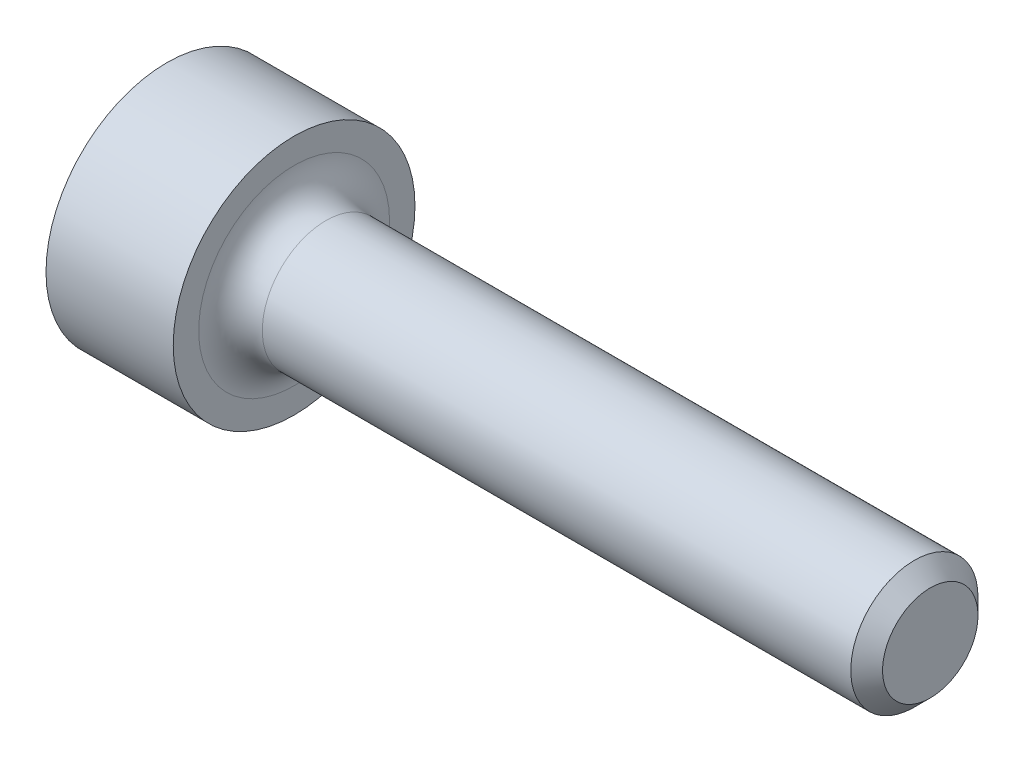
ISO-10303-21;
HEADER;
FILE_DESCRIPTION(('STEP AP214'),'2;1');
FILE_NAME('part.step','',(''),(''),'','','');
FILE_SCHEMA(('AUTOMOTIVE_DESIGN { 1 0 10303 214 1 1 1 1 }'));
ENDSEC;
DATA;
#1=APPLICATION_CONTEXT('core data for automotive mechanical design processes');
#2=APPLICATION_PROTOCOL_DEFINITION('international standard','automotive_design',2000,#1);
#3=PRODUCT_CONTEXT('',#1,'mechanical');
#4=PRODUCT('Part','Part','',(#3));
#5=PRODUCT_RELATED_PRODUCT_CATEGORY('part','',(#4));
#6=PRODUCT_DEFINITION_FORMATION('','',#4);
#7=PRODUCT_DEFINITION_CONTEXT('part definition',#1,'design');
#8=PRODUCT_DEFINITION('design','',#6,#7);
#9=PRODUCT_DEFINITION_SHAPE('','',#8);
#10=(LENGTH_UNIT() NAMED_UNIT(*) SI_UNIT(.MILLI.,.METRE.));
#11=(NAMED_UNIT(*) PLANE_ANGLE_UNIT() SI_UNIT($,.RADIAN.));
#12=(NAMED_UNIT(*) SI_UNIT($,.STERADIAN.) SOLID_ANGLE_UNIT());
#13=UNCERTAINTY_MEASURE_WITH_UNIT(LENGTH_MEASURE(1.E-05),#10,'distance_accuracy_value','');
#14=(GEOMETRIC_REPRESENTATION_CONTEXT(3) GLOBAL_UNCERTAINTY_ASSIGNED_CONTEXT((#13)) GLOBAL_UNIT_ASSIGNED_CONTEXT((#10,
#11,#12)) REPRESENTATION_CONTEXT('',''));
#15=CARTESIAN_POINT('',(0.,0.,0.));
#16=DIRECTION('',(0.,0.,1.));
#17=DIRECTION('',(1.,0.,0.));
#18=AXIS2_PLACEMENT_3D('',#15,#16,#17);
#19=CARTESIAN_POINT('',(12.,0.,0.));
#20=DIRECTION('',(1.,0.,0.));
#21=DIRECTION('',(0.,0.,-1.));
#22=AXIS2_PLACEMENT_3D('',#19,#20,#21);
#23=PLANE('',#22);
#24=CARTESIAN_POINT('',(12.,0.,0.));
#25=DIRECTION('',(1.,0.,0.));
#26=DIRECTION('',(0.,0.,-1.));
#27=AXIS2_PLACEMENT_3D('',#24,#25,#26);
#28=CIRCLE('',#27,0.750000000000001);
#29=CARTESIAN_POINT('',(12.,0.,-0.750000000000001));
#30=VERTEX_POINT('',#29);
#31=EDGE_CURVE('E11',#30,#30,#28,.T.);
#32=ORIENTED_EDGE('',*,*,#31,.T.);
#33=EDGE_LOOP('',(#32));
#34=FACE_BOUND('',#33,.T.);
#35=ADVANCED_FACE('F41',(#34),#23,.T.);
#36=CARTESIAN_POINT('',(0.,0.,0.));
#37=DIRECTION('',(-1.,0.,0.));
#38=DIRECTION('',(0.,0.,1.));
#39=AXIS2_PLACEMENT_3D('',#36,#37,#38);
#40=CYLINDRICAL_SURFACE('',#39,1.);
#41=CARTESIAN_POINT('',(11.75,0.,0.));
#42=DIRECTION('',(1.,0.,0.));
#43=DIRECTION('',(0.,0.,-1.));
#44=AXIS2_PLACEMENT_3D('',#41,#42,#43);
#45=CIRCLE('',#44,1.);
#46=CARTESIAN_POINT('',(11.75,0.,-1.));
#47=VERTEX_POINT('',#46);
#48=EDGE_CURVE('E49',#47,#47,#45,.F.);
#49=ORIENTED_EDGE('',*,*,#48,.T.);
#50=EDGE_LOOP('',(#49));
#51=FACE_BOUND('',#50,.T.);
#52=CARTESIAN_POINT('',(2.5,0.,0.));
#53=DIRECTION('',(1.,0.,0.));
#54=DIRECTION('',(0.,0.,-1.));
#55=AXIS2_PLACEMENT_3D('',#52,#53,#54);
#56=CIRCLE('',#55,1.);
#57=CARTESIAN_POINT('',(2.5,0.,-1.));
#58=VERTEX_POINT('',#57);
#59=EDGE_CURVE('E135',#58,#58,#56,.T.);
#60=ORIENTED_EDGE('',*,*,#59,.T.);
#61=EDGE_LOOP('',(#60));
#62=FACE_BOUND('',#61,.T.);
#63=ADVANCED_FACE('F140',(#51,#62),#40,.T.);
#64=CARTESIAN_POINT('',(2.,-1.9,0.));
#65=DIRECTION('',(1.,0.,0.));
#66=DIRECTION('',(0.,0.,-1.));
#67=AXIS2_PLACEMENT_3D('',#64,#65,#66);
#68=PLANE('',#67);
#69=CARTESIAN_POINT('',(2.,0.,0.));
#70=DIRECTION('',(1.,0.,0.));
#71=DIRECTION('',(0.,0.,-1.));
#72=AXIS2_PLACEMENT_3D('',#69,#70,#71);
#73=CIRCLE('',#72,1.5);
#74=CARTESIAN_POINT('',(2.,0.,-1.5));
#75=VERTEX_POINT('',#74);
#76=EDGE_CURVE('E132',#75,#75,#73,.F.);
#77=ORIENTED_EDGE('',*,*,#76,.T.);
#78=EDGE_LOOP('',(#77));
#79=FACE_BOUND('',#78,.T.);
#80=CARTESIAN_POINT('',(2.,0.,0.));
#81=DIRECTION('',(-1.,0.,0.));
#82=DIRECTION('',(0.,0.,1.));
#83=AXIS2_PLACEMENT_3D('',#80,#81,#82);
#84=CIRCLE('',#83,1.9);
#85=CARTESIAN_POINT('',(2.,0.,1.9));
#86=VERTEX_POINT('',#85);
#87=EDGE_CURVE('E129',#86,#86,#84,.T.);
#88=ORIENTED_EDGE('',*,*,#87,.F.);
#89=EDGE_LOOP('',(#88));
#90=FACE_BOUND('',#89,.T.);
#91=ADVANCED_FACE('F159',(#79,#90),#68,.T.);
#92=CARTESIAN_POINT('',(0.,0.,0.));
#93=DIRECTION('',(-1.,0.,0.));
#94=DIRECTION('',(0.,0.,1.));
#95=AXIS2_PLACEMENT_3D('',#92,#93,#94);
#96=CYLINDRICAL_SURFACE('',#95,1.9);
#97=ORIENTED_EDGE('',*,*,#87,.T.);
#98=EDGE_LOOP('',(#97));
#99=FACE_BOUND('',#98,.T.);
#100=CARTESIAN_POINT('',(0.,0.,0.));
#101=DIRECTION('',(-1.,0.,0.));
#102=DIRECTION('',(0.,0.,1.));
#103=AXIS2_PLACEMENT_3D('',#100,#101,#102);
#104=CIRCLE('',#103,1.9);
#105=CARTESIAN_POINT('',(0.,0.,1.9));
#106=VERTEX_POINT('',#105);
#107=EDGE_CURVE('E118',#106,#106,#104,.T.);
#108=ORIENTED_EDGE('',*,*,#107,.F.);
#109=EDGE_LOOP('',(#108));
#110=FACE_BOUND('',#109,.T.);
#111=ADVANCED_FACE('F171',(#99,#110),#96,.T.);
#112=CARTESIAN_POINT('',(0.,0.,0.));
#113=DIRECTION('',(-1.,0.,0.));
#114=DIRECTION('',(0.,0.,1.));
#115=AXIS2_PLACEMENT_3D('',#112,#113,#114);
#116=PLANE('',#115);
#117=DIRECTION('',(0.,0.5,-0.866025403784439));
#118=VECTOR('',#117,1.);
#119=CARTESIAN_POINT('',(0.,0.43301270189222,0.749999999999999));
#120=LINE('',#119,#118);
#121=CARTESIAN_POINT('',(0.,0.43301270189222,0.749999999999999));
#122=VERTEX_POINT('',#121);
#123=CARTESIAN_POINT('',(0.,0.866025403784439,0.));
#124=VERTEX_POINT('',#123);
#125=EDGE_CURVE('E56',#122,#124,#120,.T.);
#126=ORIENTED_EDGE('',*,*,#125,.F.);
#127=DIRECTION('',(0.,1.,0.));
#128=VECTOR('',#127,1.);
#129=CARTESIAN_POINT('',(0.,-0.433012701892219,0.75));
#130=LINE('',#129,#128);
#131=CARTESIAN_POINT('',(0.,-0.433012701892219,0.75));
#132=VERTEX_POINT('',#131);
#133=EDGE_CURVE('E91',#132,#122,#130,.T.);
#134=ORIENTED_EDGE('',*,*,#133,.F.);
#135=DIRECTION('',(0.,0.5,0.866025403784439));
#136=VECTOR('',#135,1.);
#137=CARTESIAN_POINT('',(0.,-0.866025403784438,0.));
#138=LINE('',#137,#136);
#139=CARTESIAN_POINT('',(0.,-0.866025403784438,0.));
#140=VERTEX_POINT('',#139);
#141=EDGE_CURVE('E100',#140,#132,#138,.T.);
#142=ORIENTED_EDGE('',*,*,#141,.F.);
#143=DIRECTION('',(0.,-0.5,0.866025403784439));
#144=VECTOR('',#143,1.);
#145=CARTESIAN_POINT('',(0.,-0.433012701892219,-0.75));
#146=LINE('',#145,#144);
#147=CARTESIAN_POINT('',(0.,-0.433012701892219,-0.75));
#148=VERTEX_POINT('',#147);
#149=EDGE_CURVE('E106',#148,#140,#146,.T.);
#150=ORIENTED_EDGE('',*,*,#149,.F.);
#151=DIRECTION('',(0.,-1.,0.));
#152=VECTOR('',#151,1.);
#153=CARTESIAN_POINT('',(0.,0.433012701892219,-0.75));
#154=LINE('',#153,#152);
#155=CARTESIAN_POINT('',(0.,0.433012701892219,-0.75));
#156=VERTEX_POINT('',#155);
#157=EDGE_CURVE('E249',#156,#148,#154,.T.);
#158=ORIENTED_EDGE('',*,*,#157,.F.);
#159=DIRECTION('',(0.,-0.5,-0.866025403784438));
#160=VECTOR('',#159,1.);
#161=CARTESIAN_POINT('',(0.,0.866025403784439,0.));
#162=LINE('',#161,#160);
#163=EDGE_CURVE('E247',#124,#156,#162,.T.);
#164=ORIENTED_EDGE('',*,*,#163,.F.);
#165=EDGE_LOOP('',(#126,#134,#142,#150,#158,#164));
#166=FACE_BOUND('',#165,.T.);
#167=ORIENTED_EDGE('',*,*,#107,.T.);
#168=EDGE_LOOP('',(#167));
#169=FACE_BOUND('',#168,.T.);
#170=ADVANCED_FACE('F108',(#166,#169),#116,.T.);
#171=CARTESIAN_POINT('',(2.5,0.,0.));
#172=DIRECTION('',(1.,0.,0.));
#173=DIRECTION('',(0.,0.,-1.));
#174=AXIS2_PLACEMENT_3D('',#171,#172,#173);
#175=TOROIDAL_SURFACE('',#174,1.5,0.5);
#176=ORIENTED_EDGE('',*,*,#59,.F.);
#177=EDGE_LOOP('',(#176));
#178=FACE_BOUND('',#177,.T.);
#179=ORIENTED_EDGE('',*,*,#76,.F.);
#180=EDGE_LOOP('',(#179));
#181=FACE_BOUND('',#180,.T.);
#182=ADVANCED_FACE('F162',(#178,#181),#175,.F.);
#183=CARTESIAN_POINT('',(1.,0.43301270189222,0.749999999999999));
#184=DIRECTION('',(0.,0.866025403784439,0.5));
#185=DIRECTION('',(0.,-0.5,0.866025403784439));
#186=AXIS2_PLACEMENT_3D('',#183,#184,#185);
#187=PLANE('',#186);
#188=ORIENTED_EDGE('',*,*,#125,.T.);
#189=DIRECTION('',(-1.,0.,0.));
#190=VECTOR('',#189,1.);
#191=CARTESIAN_POINT('',(1.,0.866025403784439,0.));
#192=LINE('',#191,#190);
#193=CARTESIAN_POINT('',(1.,0.866025403784439,0.));
#194=VERTEX_POINT('',#193);
#195=EDGE_CURVE('E125',#194,#124,#192,.T.);
#196=ORIENTED_EDGE('',*,*,#195,.F.);
#197=DIRECTION('',(0.,0.5,-0.866025403784439));
#198=VECTOR('',#197,1.);
#199=CARTESIAN_POINT('',(1.,0.43301270189222,0.749999999999999));
#200=LINE('',#199,#198);
#201=CARTESIAN_POINT('',(1.,0.43301270189222,0.749999999999999));
#202=VERTEX_POINT('',#201);
#203=EDGE_CURVE('E111',#202,#194,#200,.T.);
#204=ORIENTED_EDGE('',*,*,#203,.F.);
#205=DIRECTION('',(-1.,0.,0.));
#206=VECTOR('',#205,1.);
#207=CARTESIAN_POINT('',(1.,0.43301270189222,0.749999999999999));
#208=LINE('',#207,#206);
#209=EDGE_CURVE('E96',#202,#122,#208,.T.);
#210=ORIENTED_EDGE('',*,*,#209,.T.);
#211=EDGE_LOOP('',(#188,#196,#204,#210));
#212=FACE_BOUND('',#211,.T.);
#213=ADVANCED_FACE('F164',(#212),#187,.F.);
#214=CARTESIAN_POINT('',(1.,-0.433012701892219,0.75));
#215=DIRECTION('',(0.,0.,1.));
#216=DIRECTION('',(0.,-1.,0.));
#217=AXIS2_PLACEMENT_3D('',#214,#215,#216);
#218=PLANE('',#217);
#219=ORIENTED_EDGE('',*,*,#133,.T.);
#220=ORIENTED_EDGE('',*,*,#209,.F.);
#221=DIRECTION('',(0.,1.,0.));
#222=VECTOR('',#221,1.);
#223=CARTESIAN_POINT('',(1.,-0.433012701892219,0.75));
#224=LINE('',#223,#222);
#225=CARTESIAN_POINT('',(1.,-0.433012701892219,0.75));
#226=VERTEX_POINT('',#225);
#227=EDGE_CURVE('E93',#226,#202,#224,.T.);
#228=ORIENTED_EDGE('',*,*,#227,.F.);
#229=DIRECTION('',(-1.,0.,0.));
#230=VECTOR('',#229,1.);
#231=CARTESIAN_POINT('',(1.,-0.433012701892219,0.75));
#232=LINE('',#231,#230);
#233=EDGE_CURVE('E86',#226,#132,#232,.T.);
#234=ORIENTED_EDGE('',*,*,#233,.T.);
#235=EDGE_LOOP('',(#219,#220,#228,#234));
#236=FACE_BOUND('',#235,.T.);
#237=ADVANCED_FACE('F88',(#236),#218,.F.);
#238=CARTESIAN_POINT('',(1.,-0.866025403784438,0.));
#239=DIRECTION('',(0.,-0.866025403784439,0.5));
#240=DIRECTION('',(0.,-0.5,-0.866025403784439));
#241=AXIS2_PLACEMENT_3D('',#238,#239,#240);
#242=PLANE('',#241);
#243=ORIENTED_EDGE('',*,*,#141,.T.);
#244=ORIENTED_EDGE('',*,*,#233,.F.);
#245=DIRECTION('',(0.,0.5,0.866025403784439));
#246=VECTOR('',#245,1.);
#247=CARTESIAN_POINT('',(1.,-0.866025403784438,0.));
#248=LINE('',#247,#246);
#249=CARTESIAN_POINT('',(1.,-0.866025403784438,0.));
#250=VERTEX_POINT('',#249);
#251=EDGE_CURVE('E242',#250,#226,#248,.T.);
#252=ORIENTED_EDGE('',*,*,#251,.F.);
#253=DIRECTION('',(-1.,0.,0.));
#254=VECTOR('',#253,1.);
#255=CARTESIAN_POINT('',(1.,-0.866025403784438,0.));
#256=LINE('',#255,#254);
#257=EDGE_CURVE('E97',#250,#140,#256,.T.);
#258=ORIENTED_EDGE('',*,*,#257,.T.);
#259=EDGE_LOOP('',(#243,#244,#252,#258));
#260=FACE_BOUND('',#259,.T.);
#261=ADVANCED_FACE('F101',(#260),#242,.F.);
#262=CARTESIAN_POINT('',(1.,-0.433012701892219,-0.75));
#263=DIRECTION('',(0.,-0.866025403784439,-0.5));
#264=DIRECTION('',(0.,0.5,-0.866025403784439));
#265=AXIS2_PLACEMENT_3D('',#262,#263,#264);
#266=PLANE('',#265);
#267=ORIENTED_EDGE('',*,*,#149,.T.);
#268=ORIENTED_EDGE('',*,*,#257,.F.);
#269=DIRECTION('',(0.,-0.5,0.866025403784439));
#270=VECTOR('',#269,1.);
#271=CARTESIAN_POINT('',(1.,-0.433012701892219,-0.75));
#272=LINE('',#271,#270);
#273=CARTESIAN_POINT('',(1.,-0.433012701892219,-0.75));
#274=VERTEX_POINT('',#273);
#275=EDGE_CURVE('E237',#274,#250,#272,.T.);
#276=ORIENTED_EDGE('',*,*,#275,.F.);
#277=DIRECTION('',(-1.,0.,0.));
#278=VECTOR('',#277,1.);
#279=CARTESIAN_POINT('',(1.,-0.433012701892219,-0.75));
#280=LINE('',#279,#278);
#281=EDGE_CURVE('E121',#274,#148,#280,.T.);
#282=ORIENTED_EDGE('',*,*,#281,.T.);
#283=EDGE_LOOP('',(#267,#268,#276,#282));
#284=FACE_BOUND('',#283,.T.);
#285=ADVANCED_FACE('F196',(#284),#266,.F.);
#286=CARTESIAN_POINT('',(1.,0.433012701892219,-0.75));
#287=DIRECTION('',(0.,0.,-1.));
#288=DIRECTION('',(0.,1.,0.));
#289=AXIS2_PLACEMENT_3D('',#286,#287,#288);
#290=PLANE('',#289);
#291=ORIENTED_EDGE('',*,*,#157,.T.);
#292=ORIENTED_EDGE('',*,*,#281,.F.);
#293=DIRECTION('',(0.,-1.,0.));
#294=VECTOR('',#293,1.);
#295=CARTESIAN_POINT('',(1.,0.433012701892219,-0.75));
#296=LINE('',#295,#294);
#297=CARTESIAN_POINT('',(1.,0.433012701892219,-0.75));
#298=VERTEX_POINT('',#297);
#299=EDGE_CURVE('E234',#298,#274,#296,.T.);
#300=ORIENTED_EDGE('',*,*,#299,.F.);
#301=DIRECTION('',(-1.,0.,0.));
#302=VECTOR('',#301,1.);
#303=CARTESIAN_POINT('',(1.,0.433012701892219,-0.75));
#304=LINE('',#303,#302);
#305=EDGE_CURVE('E123',#298,#156,#304,.T.);
#306=ORIENTED_EDGE('',*,*,#305,.T.);
#307=EDGE_LOOP('',(#291,#292,#300,#306));
#308=FACE_BOUND('',#307,.T.);
#309=ADVANCED_FACE('F192',(#308),#290,.F.);
#310=CARTESIAN_POINT('',(1.,0.866025403784439,0.));
#311=DIRECTION('',(0.,0.866025403784438,-0.5));
#312=DIRECTION('',(0.,0.5,0.866025403784439));
#313=AXIS2_PLACEMENT_3D('',#310,#311,#312);
#314=PLANE('',#313);
#315=ORIENTED_EDGE('',*,*,#163,.T.);
#316=ORIENTED_EDGE('',*,*,#305,.F.);
#317=DIRECTION('',(0.,-0.5,-0.866025403784438));
#318=VECTOR('',#317,1.);
#319=CARTESIAN_POINT('',(1.,0.866025403784439,0.));
#320=LINE('',#319,#318);
#321=EDGE_CURVE('E114',#194,#298,#320,.T.);
#322=ORIENTED_EDGE('',*,*,#321,.F.);
#323=ORIENTED_EDGE('',*,*,#195,.T.);
#324=EDGE_LOOP('',(#315,#316,#322,#323));
#325=FACE_BOUND('',#324,.T.);
#326=ADVANCED_FACE('F188',(#325),#314,.F.);
#327=CARTESIAN_POINT('',(1.,-0.866025403784438,0.));
#328=DIRECTION('',(-1.,0.,0.));
#329=DIRECTION('',(0.,0.,1.));
#330=AXIS2_PLACEMENT_3D('',#327,#328,#329);
#331=PLANE('',#330);
#332=CARTESIAN_POINT('',(1.,0.,0.));
#333=DIRECTION('',(-1.,0.,0.));
#334=DIRECTION('',(0.,0.,1.));
#335=AXIS2_PLACEMENT_3D('',#332,#333,#334);
#336=CIRCLE('',#335,0.866025403784438);
#337=EDGE_CURVE('E65',#202,#194,#336,.T.);
#338=ORIENTED_EDGE('',*,*,#337,.F.);
#339=ORIENTED_EDGE('',*,*,#203,.T.);
#340=EDGE_LOOP('',(#338,#339));
#341=FACE_BOUND('',#340,.T.);
#342=ADVANCED_FACE('F191',(#341),#331,.F.);
#343=EDGE_CURVE('E265',#226,#202,#336,.T.);
#344=ORIENTED_EDGE('',*,*,#343,.F.);
#345=ORIENTED_EDGE('',*,*,#227,.T.);
#346=EDGE_LOOP('',(#344,#345));
#347=FACE_BOUND('',#346,.T.);
#348=ADVANCED_FACE('F206',(#347),#331,.F.);
#349=EDGE_CURVE('E264',#250,#226,#336,.T.);
#350=ORIENTED_EDGE('',*,*,#349,.F.);
#351=ORIENTED_EDGE('',*,*,#251,.T.);
#352=EDGE_LOOP('',(#350,#351));
#353=FACE_BOUND('',#352,.T.);
#354=ADVANCED_FACE('F211',(#353),#331,.F.);
#355=EDGE_CURVE('E261',#274,#250,#336,.T.);
#356=ORIENTED_EDGE('',*,*,#355,.F.);
#357=ORIENTED_EDGE('',*,*,#275,.T.);
#358=EDGE_LOOP('',(#356,#357));
#359=FACE_BOUND('',#358,.T.);
#360=ADVANCED_FACE('F219',(#359),#331,.F.);
#361=EDGE_CURVE('E228',#298,#274,#336,.T.);
#362=ORIENTED_EDGE('',*,*,#361,.F.);
#363=ORIENTED_EDGE('',*,*,#299,.T.);
#364=EDGE_LOOP('',(#362,#363));
#365=FACE_BOUND('',#364,.T.);
#366=ADVANCED_FACE('F214',(#365),#331,.F.);
#367=EDGE_CURVE('E222',#194,#298,#336,.T.);
#368=ORIENTED_EDGE('',*,*,#367,.F.);
#369=ORIENTED_EDGE('',*,*,#321,.T.);
#370=EDGE_LOOP('',(#368,#369));
#371=FACE_BOUND('',#370,.T.);
#372=ADVANCED_FACE('F149',(#371),#331,.F.);
#373=CARTESIAN_POINT('',(1.,0.,0.));
#374=DIRECTION('',(-1.,0.,0.));
#375=DIRECTION('',(0.,0.,1.));
#376=AXIS2_PLACEMENT_3D('',#373,#374,#375);
#377=CONICAL_SURFACE('',#376,0.866025403784438,1.04719755119659);
#378=CARTESIAN_POINT('',(1.50000000000001,0.,0.));
#379=VERTEX_POINT('',#378);
#380=VERTEX_LOOP('',#379);
#381=FACE_BOUND('',#380,.T.);
#382=ORIENTED_EDGE('',*,*,#337,.T.);
#383=ORIENTED_EDGE('',*,*,#367,.T.);
#384=ORIENTED_EDGE('',*,*,#361,.T.);
#385=ORIENTED_EDGE('',*,*,#355,.T.);
#386=ORIENTED_EDGE('',*,*,#349,.T.);
#387=ORIENTED_EDGE('',*,*,#343,.T.);
#388=EDGE_LOOP('',(#382,#383,#384,#385,#386,#387));
#389=FACE_BOUND('',#388,.T.);
#390=ADVANCED_FACE('F144',(#381,#389),#377,.F.);
#391=CARTESIAN_POINT('',(11.75,0.,0.));
#392=DIRECTION('',(-1.,0.,0.));
#393=DIRECTION('',(0.,0.,1.));
#394=AXIS2_PLACEMENT_3D('',#391,#392,#393);
#395=CONICAL_SURFACE('',#394,1.,0.785398163397453);
#396=ORIENTED_EDGE('',*,*,#31,.F.);
#397=EDGE_LOOP('',(#396));
#398=FACE_BOUND('',#397,.T.);
#399=ORIENTED_EDGE('',*,*,#48,.F.);
#400=EDGE_LOOP('',(#399));
#401=FACE_BOUND('',#400,.T.);
#402=ADVANCED_FACE('F43',(#398,#401),#395,.T.);
#403=CLOSED_SHELL('',(#35,#63,#91,#111,#170,#182,#213,#237,#261,#285,#309,#326,#342,#348,#354,
#360,#366,#372,#390,#402));
#404=MANIFOLD_SOLID_BREP('B2',#403);
#405=ADVANCED_BREP_SHAPE_REPRESENTATION('',(#18,#404),#14);
#406=SHAPE_DEFINITION_REPRESENTATION(#9,#405);
ENDSEC;
END-ISO-10303-21;
